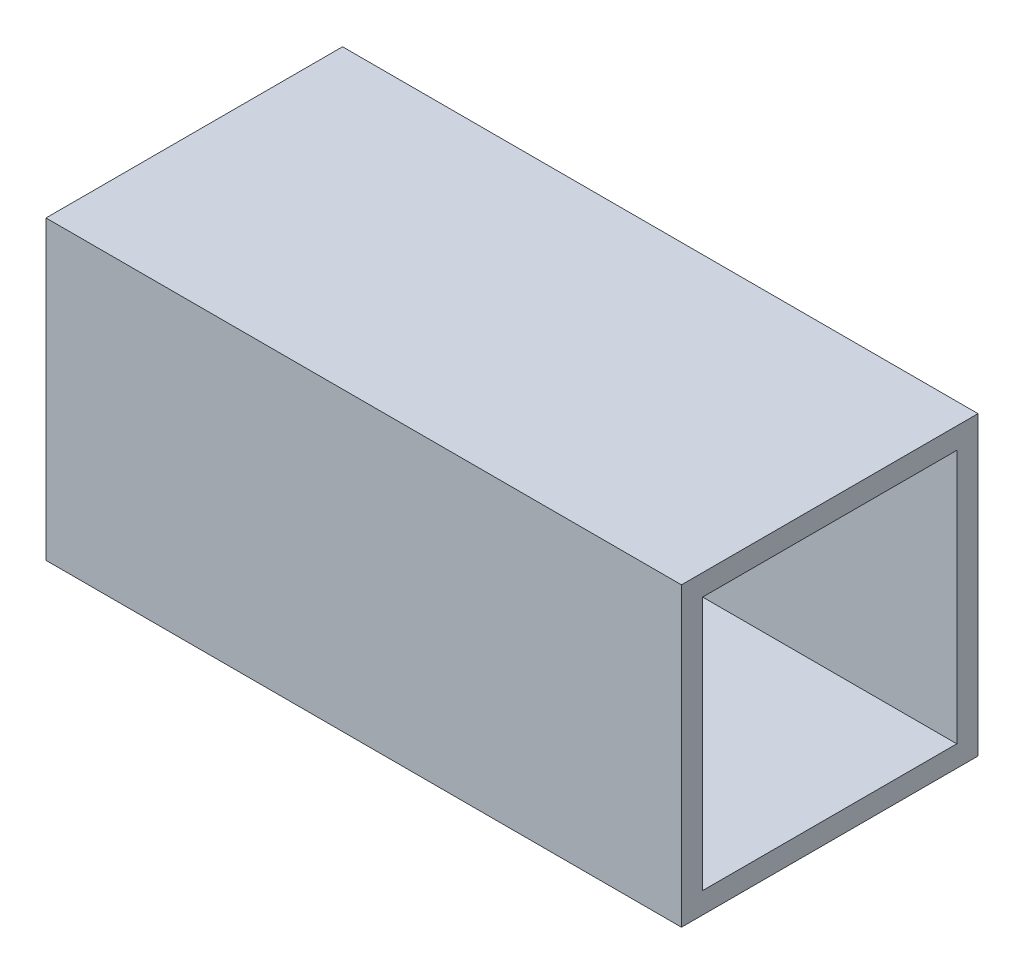
ISO-10303-21;
HEADER;
FILE_DESCRIPTION(('STEP AP214'),'2;1');
FILE_NAME('part.step','',(''),(''),'','','');
FILE_SCHEMA(('AUTOMOTIVE_DESIGN { 1 0 10303 214 1 1 1 1 }'));
ENDSEC;
DATA;
#1=APPLICATION_CONTEXT('core data for automotive mechanical design processes');
#2=APPLICATION_PROTOCOL_DEFINITION('international standard','automotive_design',2000,#1);
#3=PRODUCT_CONTEXT('',#1,'mechanical');
#4=PRODUCT('Part','Part','',(#3));
#5=PRODUCT_RELATED_PRODUCT_CATEGORY('part','',(#4));
#6=PRODUCT_DEFINITION_FORMATION('','',#4);
#7=PRODUCT_DEFINITION_CONTEXT('part definition',#1,'design');
#8=PRODUCT_DEFINITION('design','',#6,#7);
#9=PRODUCT_DEFINITION_SHAPE('','',#8);
#10=(LENGTH_UNIT() NAMED_UNIT(*) SI_UNIT(.MILLI.,.METRE.));
#11=(NAMED_UNIT(*) PLANE_ANGLE_UNIT() SI_UNIT($,.RADIAN.));
#12=(NAMED_UNIT(*) SI_UNIT($,.STERADIAN.) SOLID_ANGLE_UNIT());
#13=UNCERTAINTY_MEASURE_WITH_UNIT(LENGTH_MEASURE(1.E-05),#10,'distance_accuracy_value','');
#14=(GEOMETRIC_REPRESENTATION_CONTEXT(3) GLOBAL_UNCERTAINTY_ASSIGNED_CONTEXT((#13)) GLOBAL_UNIT_ASSIGNED_CONTEXT((#10,
#11,#12)) REPRESENTATION_CONTEXT('',''));
#15=CARTESIAN_POINT('',(0.,0.,0.));
#16=DIRECTION('',(0.,0.,1.));
#17=DIRECTION('',(1.,0.,0.));
#18=AXIS2_PLACEMENT_3D('',#15,#16,#17);
#19=CARTESIAN_POINT('',(47.625,0.,0.));
#20=DIRECTION('',(1.,0.,0.));
#21=DIRECTION('',(0.,0.,-1.));
#22=AXIS2_PLACEMENT_3D('',#19,#20,#21);
#23=PLANE('',#22);
#24=DIRECTION('',(0.,-1.,0.));
#25=VECTOR('',#24,1.);
#26=CARTESIAN_POINT('',(47.625,44.45,0.));
#27=LINE('',#26,#25);
#28=CARTESIAN_POINT('',(47.625,44.45,0.));
#29=VERTEX_POINT('',#28);
#30=CARTESIAN_POINT('',(47.625,0.,0.));
#31=VERTEX_POINT('',#30);
#32=EDGE_CURVE('E134',#29,#31,#27,.T.);
#33=ORIENTED_EDGE('',*,*,#32,.T.);
#34=DIRECTION('',(0.,0.,-1.));
#35=VECTOR('',#34,1.);
#36=CARTESIAN_POINT('',(47.625,0.,0.));
#37=LINE('',#36,#35);
#38=CARTESIAN_POINT('',(47.625,0.,-44.45));
#39=VERTEX_POINT('',#38);
#40=EDGE_CURVE('E137',#31,#39,#37,.T.);
#41=ORIENTED_EDGE('',*,*,#40,.T.);
#42=DIRECTION('',(0.,1.,0.));
#43=VECTOR('',#42,1.);
#44=CARTESIAN_POINT('',(47.625,0.,-44.45));
#45=LINE('',#44,#43);
#46=CARTESIAN_POINT('',(47.625,44.45,-44.45));
#47=VERTEX_POINT('',#46);
#48=EDGE_CURVE('E140',#39,#47,#45,.T.);
#49=ORIENTED_EDGE('',*,*,#48,.T.);
#50=DIRECTION('',(0.,0.,1.));
#51=VECTOR('',#50,1.);
#52=CARTESIAN_POINT('',(47.625,44.45,-44.45));
#53=LINE('',#52,#51);
#54=EDGE_CURVE('E142',#47,#29,#53,.T.);
#55=ORIENTED_EDGE('',*,*,#54,.T.);
#56=EDGE_LOOP('',(#33,#41,#49,#55));
#57=FACE_BOUND('',#56,.T.);
#58=DIRECTION('',(0.,0.,1.));
#59=VECTOR('',#58,1.);
#60=CARTESIAN_POINT('',(47.625,41.275,-41.275));
#61=LINE('',#60,#59);
#62=CARTESIAN_POINT('',(47.625,41.275,-41.275));
#63=VERTEX_POINT('',#62);
#64=CARTESIAN_POINT('',(47.625,41.275,-3.175));
#65=VERTEX_POINT('',#64);
#66=EDGE_CURVE('E106',#63,#65,#61,.T.);
#67=ORIENTED_EDGE('',*,*,#66,.F.);
#68=DIRECTION('',(0.,1.,0.));
#69=VECTOR('',#68,1.);
#70=CARTESIAN_POINT('',(47.625,3.175,-41.275));
#71=LINE('',#70,#69);
#72=CARTESIAN_POINT('',(47.625,3.175,-41.275));
#73=VERTEX_POINT('',#72);
#74=EDGE_CURVE('E98',#73,#63,#71,.T.);
#75=ORIENTED_EDGE('',*,*,#74,.F.);
#76=DIRECTION('',(0.,0.,-1.));
#77=VECTOR('',#76,1.);
#78=CARTESIAN_POINT('',(47.625,3.175,-3.17500000000001));
#79=LINE('',#78,#77);
#80=CARTESIAN_POINT('',(47.625,3.175,-3.17500000000001));
#81=VERTEX_POINT('',#80);
#82=EDGE_CURVE('E120',#81,#73,#79,.T.);
#83=ORIENTED_EDGE('',*,*,#82,.F.);
#84=DIRECTION('',(0.,-1.,0.));
#85=VECTOR('',#84,1.);
#86=CARTESIAN_POINT('',(47.625,41.275,-3.175));
#87=LINE('',#86,#85);
#88=EDGE_CURVE('E118',#65,#81,#87,.T.);
#89=ORIENTED_EDGE('',*,*,#88,.F.);
#90=EDGE_LOOP('',(#67,#75,#83,#89));
#91=FACE_BOUND('',#90,.T.);
#92=ADVANCED_FACE('F33',(#57,#91),#23,.T.);
#93=CARTESIAN_POINT('',(-47.625,0.,0.));
#94=DIRECTION('',(1.,0.,0.));
#95=DIRECTION('',(0.,0.,-1.));
#96=AXIS2_PLACEMENT_3D('',#93,#94,#95);
#97=PLANE('',#96);
#98=DIRECTION('',(0.,-1.,0.));
#99=VECTOR('',#98,1.);
#100=CARTESIAN_POINT('',(-47.625,44.45,0.));
#101=LINE('',#100,#99);
#102=CARTESIAN_POINT('',(-47.625,44.45,0.));
#103=VERTEX_POINT('',#102);
#104=CARTESIAN_POINT('',(-47.625,0.,0.));
#105=VERTEX_POINT('',#104);
#106=EDGE_CURVE('E114',#103,#105,#101,.T.);
#107=ORIENTED_EDGE('',*,*,#106,.F.);
#108=DIRECTION('',(0.,0.,1.));
#109=VECTOR('',#108,1.);
#110=CARTESIAN_POINT('',(-47.625,44.45,-44.45));
#111=LINE('',#110,#109);
#112=CARTESIAN_POINT('',(-47.625,44.45,-44.45));
#113=VERTEX_POINT('',#112);
#114=EDGE_CURVE('E138',#113,#103,#111,.T.);
#115=ORIENTED_EDGE('',*,*,#114,.F.);
#116=DIRECTION('',(0.,1.,0.));
#117=VECTOR('',#116,1.);
#118=CARTESIAN_POINT('',(-47.625,0.,-44.45));
#119=LINE('',#118,#117);
#120=CARTESIAN_POINT('',(-47.625,0.,-44.45));
#121=VERTEX_POINT('',#120);
#122=EDGE_CURVE('E149',#121,#113,#119,.T.);
#123=ORIENTED_EDGE('',*,*,#122,.F.);
#124=DIRECTION('',(0.,0.,-1.));
#125=VECTOR('',#124,1.);
#126=CARTESIAN_POINT('',(-47.625,0.,0.));
#127=LINE('',#126,#125);
#128=EDGE_CURVE('E147',#105,#121,#127,.T.);
#129=ORIENTED_EDGE('',*,*,#128,.F.);
#130=EDGE_LOOP('',(#107,#115,#123,#129));
#131=FACE_BOUND('',#130,.T.);
#132=DIRECTION('',(0.,1.,0.));
#133=VECTOR('',#132,1.);
#134=CARTESIAN_POINT('',(-47.625,3.175,-41.275));
#135=LINE('',#134,#133);
#136=CARTESIAN_POINT('',(-47.625,3.175,-41.275));
#137=VERTEX_POINT('',#136);
#138=CARTESIAN_POINT('',(-47.625,41.275,-41.275));
#139=VERTEX_POINT('',#138);
#140=EDGE_CURVE('E56',#137,#139,#135,.T.);
#141=ORIENTED_EDGE('',*,*,#140,.T.);
#142=DIRECTION('',(0.,0.,1.));
#143=VECTOR('',#142,1.);
#144=CARTESIAN_POINT('',(-47.625,41.275,-41.275));
#145=LINE('',#144,#143);
#146=CARTESIAN_POINT('',(-47.625,41.275,-3.175));
#147=VERTEX_POINT('',#146);
#148=EDGE_CURVE('E113',#139,#147,#145,.T.);
#149=ORIENTED_EDGE('',*,*,#148,.T.);
#150=DIRECTION('',(0.,-1.,0.));
#151=VECTOR('',#150,1.);
#152=CARTESIAN_POINT('',(-47.625,41.275,-3.175));
#153=LINE('',#152,#151);
#154=CARTESIAN_POINT('',(-47.625,3.175,-3.17500000000001));
#155=VERTEX_POINT('',#154);
#156=EDGE_CURVE('E126',#147,#155,#153,.T.);
#157=ORIENTED_EDGE('',*,*,#156,.T.);
#158=DIRECTION('',(0.,0.,-1.));
#159=VECTOR('',#158,1.);
#160=CARTESIAN_POINT('',(-47.625,3.175,-3.17500000000001));
#161=LINE('',#160,#159);
#162=EDGE_CURVE('E107',#155,#137,#161,.T.);
#163=ORIENTED_EDGE('',*,*,#162,.T.);
#164=EDGE_LOOP('',(#141,#149,#157,#163));
#165=FACE_BOUND('',#164,.T.);
#166=ADVANCED_FACE('F167',(#131,#165),#97,.F.);
#167=CARTESIAN_POINT('',(47.625,44.45,0.));
#168=DIRECTION('',(0.,0.,-1.));
#169=DIRECTION('',(0.,1.,0.));
#170=AXIS2_PLACEMENT_3D('',#167,#168,#169);
#171=PLANE('',#170);
#172=ORIENTED_EDGE('',*,*,#106,.T.);
#173=DIRECTION('',(-1.,0.,0.));
#174=VECTOR('',#173,1.);
#175=CARTESIAN_POINT('',(47.625,0.,0.));
#176=LINE('',#175,#174);
#177=EDGE_CURVE('E11',#31,#105,#176,.T.);
#178=ORIENTED_EDGE('',*,*,#177,.F.);
#179=ORIENTED_EDGE('',*,*,#32,.F.);
#180=DIRECTION('',(-1.,0.,0.));
#181=VECTOR('',#180,1.);
#182=CARTESIAN_POINT('',(47.625,44.45,0.));
#183=LINE('',#182,#181);
#184=EDGE_CURVE('E144',#29,#103,#183,.T.);
#185=ORIENTED_EDGE('',*,*,#184,.T.);
#186=EDGE_LOOP('',(#172,#178,#179,#185));
#187=FACE_BOUND('',#186,.T.);
#188=ADVANCED_FACE('F35',(#187),#171,.F.);
#189=CARTESIAN_POINT('',(47.625,0.,0.));
#190=DIRECTION('',(0.,1.,0.));
#191=DIRECTION('',(0.,0.,1.));
#192=AXIS2_PLACEMENT_3D('',#189,#190,#191);
#193=PLANE('',#192);
#194=ORIENTED_EDGE('',*,*,#128,.T.);
#195=DIRECTION('',(-1.,0.,0.));
#196=VECTOR('',#195,1.);
#197=CARTESIAN_POINT('',(47.625,0.,-44.45));
#198=LINE('',#197,#196);
#199=EDGE_CURVE('E41',#39,#121,#198,.T.);
#200=ORIENTED_EDGE('',*,*,#199,.F.);
#201=ORIENTED_EDGE('',*,*,#40,.F.);
#202=ORIENTED_EDGE('',*,*,#177,.T.);
#203=EDGE_LOOP('',(#194,#200,#201,#202));
#204=FACE_BOUND('',#203,.T.);
#205=ADVANCED_FACE('F177',(#204),#193,.F.);
#206=CARTESIAN_POINT('',(47.625,0.,-44.45));
#207=DIRECTION('',(0.,0.,1.));
#208=DIRECTION('',(0.,-1.,0.));
#209=AXIS2_PLACEMENT_3D('',#206,#207,#208);
#210=PLANE('',#209);
#211=ORIENTED_EDGE('',*,*,#122,.T.);
#212=DIRECTION('',(-1.,0.,0.));
#213=VECTOR('',#212,1.);
#214=CARTESIAN_POINT('',(47.625,44.45,-44.45));
#215=LINE('',#214,#213);
#216=EDGE_CURVE('E154',#47,#113,#215,.T.);
#217=ORIENTED_EDGE('',*,*,#216,.F.);
#218=ORIENTED_EDGE('',*,*,#48,.F.);
#219=ORIENTED_EDGE('',*,*,#199,.T.);
#220=EDGE_LOOP('',(#211,#217,#218,#219));
#221=FACE_BOUND('',#220,.T.);
#222=ADVANCED_FACE('F161',(#221),#210,.F.);
#223=CARTESIAN_POINT('',(47.625,44.45,-44.45));
#224=DIRECTION('',(0.,-1.,0.));
#225=DIRECTION('',(0.,0.,-1.));
#226=AXIS2_PLACEMENT_3D('',#223,#224,#225);
#227=PLANE('',#226);
#228=ORIENTED_EDGE('',*,*,#114,.T.);
#229=ORIENTED_EDGE('',*,*,#184,.F.);
#230=ORIENTED_EDGE('',*,*,#54,.F.);
#231=ORIENTED_EDGE('',*,*,#216,.T.);
#232=EDGE_LOOP('',(#228,#229,#230,#231));
#233=FACE_BOUND('',#232,.T.);
#234=ADVANCED_FACE('F171',(#233),#227,.F.);
#235=CARTESIAN_POINT('',(47.625,3.175,-41.275));
#236=DIRECTION('',(0.,0.,1.));
#237=DIRECTION('',(0.,-1.,0.));
#238=AXIS2_PLACEMENT_3D('',#235,#236,#237);
#239=PLANE('',#238);
#240=ORIENTED_EDGE('',*,*,#140,.F.);
#241=DIRECTION('',(-1.,0.,0.));
#242=VECTOR('',#241,1.);
#243=CARTESIAN_POINT('',(47.625,3.175,-41.275));
#244=LINE('',#243,#242);
#245=EDGE_CURVE('E102',#73,#137,#244,.T.);
#246=ORIENTED_EDGE('',*,*,#245,.F.);
#247=ORIENTED_EDGE('',*,*,#74,.T.);
#248=DIRECTION('',(-1.,0.,0.));
#249=VECTOR('',#248,1.);
#250=CARTESIAN_POINT('',(47.625,41.275,-41.275));
#251=LINE('',#250,#249);
#252=EDGE_CURVE('E101',#63,#139,#251,.T.);
#253=ORIENTED_EDGE('',*,*,#252,.T.);
#254=EDGE_LOOP('',(#240,#246,#247,#253));
#255=FACE_BOUND('',#254,.T.);
#256=ADVANCED_FACE('F100',(#255),#239,.T.);
#257=CARTESIAN_POINT('',(47.625,41.275,-41.275));
#258=DIRECTION('',(0.,-1.,0.));
#259=DIRECTION('',(0.,0.,-1.));
#260=AXIS2_PLACEMENT_3D('',#257,#258,#259);
#261=PLANE('',#260);
#262=ORIENTED_EDGE('',*,*,#148,.F.);
#263=ORIENTED_EDGE('',*,*,#252,.F.);
#264=ORIENTED_EDGE('',*,*,#66,.T.);
#265=DIRECTION('',(-1.,0.,0.));
#266=VECTOR('',#265,1.);
#267=CARTESIAN_POINT('',(47.625,41.275,-3.175));
#268=LINE('',#267,#266);
#269=EDGE_CURVE('E115',#65,#147,#268,.T.);
#270=ORIENTED_EDGE('',*,*,#269,.T.);
#271=EDGE_LOOP('',(#262,#263,#264,#270));
#272=FACE_BOUND('',#271,.T.);
#273=ADVANCED_FACE('F110',(#272),#261,.T.);
#274=CARTESIAN_POINT('',(47.625,41.275,-3.175));
#275=DIRECTION('',(0.,0.,-1.));
#276=DIRECTION('',(0.,1.,0.));
#277=AXIS2_PLACEMENT_3D('',#274,#275,#276);
#278=PLANE('',#277);
#279=ORIENTED_EDGE('',*,*,#156,.F.);
#280=ORIENTED_EDGE('',*,*,#269,.F.);
#281=ORIENTED_EDGE('',*,*,#88,.T.);
#282=DIRECTION('',(-1.,0.,0.));
#283=VECTOR('',#282,1.);
#284=CARTESIAN_POINT('',(47.625,3.175,-3.17500000000001));
#285=LINE('',#284,#283);
#286=EDGE_CURVE('E48',#81,#155,#285,.T.);
#287=ORIENTED_EDGE('',*,*,#286,.T.);
#288=EDGE_LOOP('',(#279,#280,#281,#287));
#289=FACE_BOUND('',#288,.T.);
#290=ADVANCED_FACE('F200',(#289),#278,.T.);
#291=CARTESIAN_POINT('',(47.625,3.175,-3.17500000000001));
#292=DIRECTION('',(0.,1.,0.));
#293=DIRECTION('',(0.,0.,1.));
#294=AXIS2_PLACEMENT_3D('',#291,#292,#293);
#295=PLANE('',#294);
#296=ORIENTED_EDGE('',*,*,#162,.F.);
#297=ORIENTED_EDGE('',*,*,#286,.F.);
#298=ORIENTED_EDGE('',*,*,#82,.T.);
#299=ORIENTED_EDGE('',*,*,#245,.T.);
#300=EDGE_LOOP('',(#296,#297,#298,#299));
#301=FACE_BOUND('',#300,.T.);
#302=ADVANCED_FACE('F204',(#301),#295,.T.);
#303=CLOSED_SHELL('',(#92,#166,#188,#205,#222,#234,#256,#273,#290,#302));
#304=MANIFOLD_SOLID_BREP('B2',#303);
#305=ADVANCED_BREP_SHAPE_REPRESENTATION('',(#18,#304),#14);
#306=SHAPE_DEFINITION_REPRESENTATION(#9,#305);
ENDSEC;
END-ISO-10303-21;
